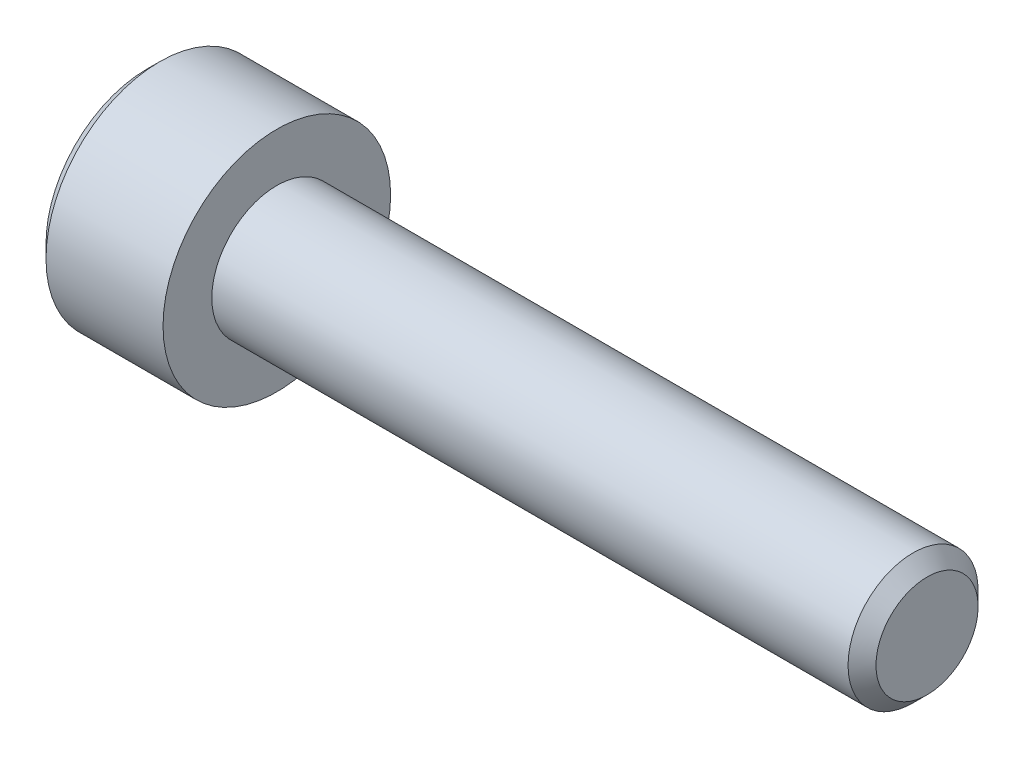
ISO-10303-21;
HEADER;
FILE_DESCRIPTION(('STEP AP214'),'2;1');
FILE_NAME('part.step','',(''),(''),'','','');
FILE_SCHEMA(('AUTOMOTIVE_DESIGN { 1 0 10303 214 1 1 1 1 }'));
ENDSEC;
DATA;
#1=APPLICATION_CONTEXT('core data for automotive mechanical design processes');
#2=APPLICATION_PROTOCOL_DEFINITION('international standard','automotive_design',2000,#1);
#3=PRODUCT_CONTEXT('',#1,'mechanical');
#4=PRODUCT('Part','Part','',(#3));
#5=PRODUCT_RELATED_PRODUCT_CATEGORY('part','',(#4));
#6=PRODUCT_DEFINITION_FORMATION('','',#4);
#7=PRODUCT_DEFINITION_CONTEXT('part definition',#1,'design');
#8=PRODUCT_DEFINITION('design','',#6,#7);
#9=PRODUCT_DEFINITION_SHAPE('','',#8);
#10=(LENGTH_UNIT() NAMED_UNIT(*) SI_UNIT(.MILLI.,.METRE.));
#11=(NAMED_UNIT(*) PLANE_ANGLE_UNIT() SI_UNIT($,.RADIAN.));
#12=(NAMED_UNIT(*) SI_UNIT($,.STERADIAN.) SOLID_ANGLE_UNIT());
#13=UNCERTAINTY_MEASURE_WITH_UNIT(LENGTH_MEASURE(1.E-05),#10,'distance_accuracy_value','');
#14=(GEOMETRIC_REPRESENTATION_CONTEXT(3) GLOBAL_UNCERTAINTY_ASSIGNED_CONTEXT((#13)) GLOBAL_UNIT_ASSIGNED_CONTEXT((#10,
#11,#12)) REPRESENTATION_CONTEXT('',''));
#15=CARTESIAN_POINT('',(0.,0.,0.));
#16=DIRECTION('',(0.,0.,1.));
#17=DIRECTION('',(1.,0.,0.));
#18=AXIS2_PLACEMENT_3D('',#15,#16,#17);
#19=CARTESIAN_POINT('',(-2.,0.,0.));
#20=DIRECTION('',(1.,0.,0.));
#21=DIRECTION('',(0.,0.,-1.));
#22=AXIS2_PLACEMENT_3D('',#19,#20,#21);
#23=PLANE('',#22);
#24=DIRECTION('',(0.,1.,0.));
#25=VECTOR('',#24,1.);
#26=CARTESIAN_POINT('',(-2.,0.866025403784439,1.5));
#27=LINE('',#26,#25);
#28=CARTESIAN_POINT('',(-2.,0.86602540378444,1.5));
#29=VERTEX_POINT('',#28);
#30=CARTESIAN_POINT('',(-1.99999999999056,0.,1.49999999998226));
#31=VERTEX_POINT('',#30);
#32=EDGE_CURVE('E92',#29,#31,#27,.F.);
#33=ORIENTED_EDGE('',*,*,#32,.F.);
#34=DIRECTION('',(0.,0.5,-0.866025403784439));
#35=VECTOR('',#34,1.);
#36=CARTESIAN_POINT('',(-2.,1.73205080756888,0.));
#37=LINE('',#36,#35);
#38=CARTESIAN_POINT('',(-1.99999999999056,1.2990381056613,0.749999999991132));
#39=VERTEX_POINT('',#38);
#40=EDGE_CURVE('E88',#39,#29,#37,.F.);
#41=ORIENTED_EDGE('',*,*,#40,.F.);
#42=CARTESIAN_POINT('',(-1.99999999998113,0.,0.));
#43=DIRECTION('',(-1.,0.,0.));
#44=DIRECTION('',(0.,0.,1.));
#45=AXIS2_PLACEMENT_3D('',#42,#43,#44);
#46=CIRCLE('',#45,1.49999999996453);
#47=EDGE_CURVE('E20',#39,#31,#46,.F.);
#48=ORIENTED_EDGE('',*,*,#47,.T.);
#49=EDGE_LOOP('',(#33,#41,#48));
#50=FACE_BOUND('',#49,.T.);
#51=ADVANCED_FACE('F17',(#50),#23,.F.);
#52=CARTESIAN_POINT('',(-2.,0.,0.));
#53=DIRECTION('',(1.,0.,0.));
#54=DIRECTION('',(0.,0.,-1.));
#55=AXIS2_PLACEMENT_3D('',#52,#53,#54);
#56=PLANE('',#55);
#57=CARTESIAN_POINT('',(-1.99999999998113,0.,0.));
#58=DIRECTION('',(-1.,0.,0.));
#59=DIRECTION('',(0.,0.,1.));
#60=AXIS2_PLACEMENT_3D('',#57,#58,#59);
#61=CIRCLE('',#60,1.49999999996453);
#62=CARTESIAN_POINT('',(-1.99999999999056,1.2990381056613,-0.749999999991131));
#63=VERTEX_POINT('',#62);
#64=EDGE_CURVE('E104',#63,#39,#61,.F.);
#65=ORIENTED_EDGE('',*,*,#64,.T.);
#66=DIRECTION('',(0.,0.5,-0.866025403784439));
#67=VECTOR('',#66,1.);
#68=CARTESIAN_POINT('',(-2.,1.73205080756888,0.));
#69=LINE('',#68,#67);
#70=CARTESIAN_POINT('',(-2.,1.73205080756888,0.));
#71=VERTEX_POINT('',#70);
#72=EDGE_CURVE('E98',#71,#39,#69,.F.);
#73=ORIENTED_EDGE('',*,*,#72,.F.);
#74=DIRECTION('',(0.,-0.5,-0.866025403784439));
#75=VECTOR('',#74,1.);
#76=CARTESIAN_POINT('',(-2.,0.866025403784439,-1.5));
#77=LINE('',#76,#75);
#78=EDGE_CURVE('E114',#63,#71,#77,.F.);
#79=ORIENTED_EDGE('',*,*,#78,.F.);
#80=EDGE_LOOP('',(#65,#73,#79));
#81=FACE_BOUND('',#80,.T.);
#82=ADVANCED_FACE('F111',(#81),#56,.F.);
#83=CARTESIAN_POINT('',(-2.,1.73205080756888,0.));
#84=DIRECTION('',(0.,-0.866025403784439,-0.5));
#85=DIRECTION('',(0.,0.5,-0.866025403784439));
#86=AXIS2_PLACEMENT_3D('',#83,#84,#85);
#87=PLANE('',#86);
#88=ORIENTED_EDGE('',*,*,#40,.T.);
#89=DIRECTION('',(-1.,0.,0.));
#90=VECTOR('',#89,1.);
#91=CARTESIAN_POINT('',(-2.,0.866025403784439,1.5));
#92=LINE('',#91,#90);
#93=CARTESIAN_POINT('',(-4.,0.86602540378444,1.5));
#94=VERTEX_POINT('',#93);
#95=EDGE_CURVE('E132',#94,#29,#92,.F.);
#96=ORIENTED_EDGE('',*,*,#95,.F.);
#97=DIRECTION('',(0.,0.5,-0.866025403784439));
#98=VECTOR('',#97,1.);
#99=CARTESIAN_POINT('',(-4.,1.73205080756888,0.));
#100=LINE('',#99,#98);
#101=CARTESIAN_POINT('',(-4.,1.73205080756888,0.));
#102=VERTEX_POINT('',#101);
#103=EDGE_CURVE('E122',#94,#102,#100,.T.);
#104=ORIENTED_EDGE('',*,*,#103,.T.);
#105=DIRECTION('',(1.,0.,0.));
#106=VECTOR('',#105,1.);
#107=CARTESIAN_POINT('',(-2.,1.73205080756888,0.));
#108=LINE('',#107,#106);
#109=EDGE_CURVE('E121',#71,#102,#108,.F.);
#110=ORIENTED_EDGE('',*,*,#109,.F.);
#111=ORIENTED_EDGE('',*,*,#72,.T.);
#112=EDGE_LOOP('',(#88,#96,#104,#110,#111));
#113=FACE_BOUND('',#112,.T.);
#114=ADVANCED_FACE('F118',(#113),#87,.T.);
#115=CARTESIAN_POINT('',(-2.,0.866025403784439,1.5));
#116=DIRECTION('',(0.,0.,-1.));
#117=DIRECTION('',(-1.,0.,0.));
#118=AXIS2_PLACEMENT_3D('',#115,#116,#117);
#119=PLANE('',#118);
#120=DIRECTION('',(0.,1.,0.));
#121=VECTOR('',#120,1.);
#122=CARTESIAN_POINT('',(-2.,0.,1.5));
#123=LINE('',#122,#121);
#124=CARTESIAN_POINT('',(-2.,-0.866025403784439,1.5));
#125=VERTEX_POINT('',#124);
#126=EDGE_CURVE('E108',#31,#125,#123,.F.);
#127=ORIENTED_EDGE('',*,*,#126,.T.);
#128=DIRECTION('',(1.,0.,0.));
#129=VECTOR('',#128,1.);
#130=CARTESIAN_POINT('',(-2.,-0.866025403784439,1.5));
#131=LINE('',#130,#129);
#132=CARTESIAN_POINT('',(-4.,-0.866025403784439,1.5));
#133=VERTEX_POINT('',#132);
#134=EDGE_CURVE('E177',#133,#125,#131,.T.);
#135=ORIENTED_EDGE('',*,*,#134,.F.);
#136=DIRECTION('',(0.,1.,0.));
#137=VECTOR('',#136,1.);
#138=CARTESIAN_POINT('',(-4.,0.866025403784439,1.5));
#139=LINE('',#138,#137);
#140=EDGE_CURVE('E97',#133,#94,#139,.T.);
#141=ORIENTED_EDGE('',*,*,#140,.T.);
#142=ORIENTED_EDGE('',*,*,#95,.T.);
#143=ORIENTED_EDGE('',*,*,#32,.T.);
#144=EDGE_LOOP('',(#127,#135,#141,#142,#143));
#145=FACE_BOUND('',#144,.T.);
#146=ADVANCED_FACE('F264',(#145),#119,.T.);
#147=CARTESIAN_POINT('',(-2.,0.,0.));
#148=DIRECTION('',(1.,0.,0.));
#149=DIRECTION('',(0.,0.,-1.));
#150=AXIS2_PLACEMENT_3D('',#147,#148,#149);
#151=PLANE('',#150);
#152=DIRECTION('',(0.,0.5,0.866025403784439));
#153=VECTOR('',#152,1.);
#154=CARTESIAN_POINT('',(-2.,-0.866025403784439,1.5));
#155=LINE('',#154,#153);
#156=CARTESIAN_POINT('',(-1.99999999999056,-1.2990381056613,0.749999999991131));
#157=VERTEX_POINT('',#156);
#158=EDGE_CURVE('E168',#125,#157,#155,.F.);
#159=ORIENTED_EDGE('',*,*,#158,.F.);
#160=ORIENTED_EDGE('',*,*,#126,.F.);
#161=CARTESIAN_POINT('',(-1.99999999998113,0.,0.));
#162=DIRECTION('',(-1.,0.,0.));
#163=DIRECTION('',(0.,0.,1.));
#164=AXIS2_PLACEMENT_3D('',#161,#162,#163);
#165=CIRCLE('',#164,1.49999999996453);
#166=EDGE_CURVE('E107',#31,#157,#165,.F.);
#167=ORIENTED_EDGE('',*,*,#166,.T.);
#168=EDGE_LOOP('',(#159,#160,#167));
#169=FACE_BOUND('',#168,.T.);
#170=ADVANCED_FACE('F167',(#169),#151,.F.);
#171=CARTESIAN_POINT('',(-1.99999999998113,0.,0.));
#172=DIRECTION('',(-1.,0.,0.));
#173=DIRECTION('',(0.,0.,1.));
#174=AXIS2_PLACEMENT_3D('',#171,#172,#173);
#175=CONICAL_SURFACE('',#174,1.49999999996453,1.30899693899977);
#176=CARTESIAN_POINT('',(-1.59807621136565,0.,5.6843418860808E-11));
#177=VERTEX_POINT('',#176);
#178=VERTEX_LOOP('',#177);
#179=FACE_BOUND('',#178,.T.);
#180=CARTESIAN_POINT('',(-1.99999999998113,0.,0.));
#181=DIRECTION('',(-1.,0.,0.));
#182=DIRECTION('',(0.,0.,1.));
#183=AXIS2_PLACEMENT_3D('',#180,#181,#182);
#184=CIRCLE('',#183,1.49999999996453);
#185=CARTESIAN_POINT('',(-1.99999999999056,0.,-1.49999999998226));
#186=VERTEX_POINT('',#185);
#187=EDGE_CURVE('E116',#63,#186,#184,.T.);
#188=ORIENTED_EDGE('',*,*,#187,.T.);
#189=CARTESIAN_POINT('',(-1.99999999998113,0.,0.));
#190=DIRECTION('',(-1.,0.,0.));
#191=DIRECTION('',(0.,0.,1.));
#192=AXIS2_PLACEMENT_3D('',#189,#190,#191);
#193=CIRCLE('',#192,1.49999999996453);
#194=CARTESIAN_POINT('',(-1.99999999999056,-1.2990381056613,-0.749999999991133));
#195=VERTEX_POINT('',#194);
#196=EDGE_CURVE('E159',#186,#195,#193,.T.);
#197=ORIENTED_EDGE('',*,*,#196,.T.);
#198=CARTESIAN_POINT('',(-1.99999999998113,0.,0.));
#199=DIRECTION('',(-1.,0.,0.));
#200=DIRECTION('',(0.,0.,1.));
#201=AXIS2_PLACEMENT_3D('',#198,#199,#200);
#202=CIRCLE('',#201,1.49999999996453);
#203=EDGE_CURVE('E161',#195,#157,#202,.T.);
#204=ORIENTED_EDGE('',*,*,#203,.T.);
#205=ORIENTED_EDGE('',*,*,#166,.F.);
#206=ORIENTED_EDGE('',*,*,#47,.F.);
#207=ORIENTED_EDGE('',*,*,#64,.F.);
#208=EDGE_LOOP('',(#188,#197,#204,#205,#206,#207));
#209=FACE_BOUND('',#208,.T.);
#210=ADVANCED_FACE('F103',(#179,#209),#175,.F.);
#211=CARTESIAN_POINT('',(-2.,0.,0.));
#212=DIRECTION('',(1.,0.,0.));
#213=DIRECTION('',(0.,0.,-1.));
#214=AXIS2_PLACEMENT_3D('',#211,#212,#213);
#215=PLANE('',#214);
#216=DIRECTION('',(0.,-0.5,-0.866025403784439));
#217=VECTOR('',#216,1.);
#218=CARTESIAN_POINT('',(-2.,0.866025403784439,-1.5));
#219=LINE('',#218,#217);
#220=CARTESIAN_POINT('',(-2.,0.866025403784438,-1.5));
#221=VERTEX_POINT('',#220);
#222=EDGE_CURVE('E145',#221,#63,#219,.F.);
#223=ORIENTED_EDGE('',*,*,#222,.F.);
#224=DIRECTION('',(0.,1.,0.));
#225=VECTOR('',#224,1.);
#226=CARTESIAN_POINT('',(-2.,-0.866025403784439,-1.5));
#227=LINE('',#226,#225);
#228=EDGE_CURVE('E208',#186,#221,#227,.T.);
#229=ORIENTED_EDGE('',*,*,#228,.F.);
#230=ORIENTED_EDGE('',*,*,#187,.F.);
#231=EDGE_LOOP('',(#223,#229,#230));
#232=FACE_BOUND('',#231,.T.);
#233=ADVANCED_FACE('F239',(#232),#215,.F.);
#234=CARTESIAN_POINT('',(-2.,0.866025403784439,-1.5));
#235=DIRECTION('',(0.,-0.866025403784439,0.5));
#236=DIRECTION('',(0.,-0.5,-0.866025403784439));
#237=AXIS2_PLACEMENT_3D('',#234,#235,#236);
#238=PLANE('',#237);
#239=ORIENTED_EDGE('',*,*,#78,.T.);
#240=ORIENTED_EDGE('',*,*,#109,.T.);
#241=DIRECTION('',(0.,-0.5,-0.866025403784439));
#242=VECTOR('',#241,1.);
#243=CARTESIAN_POINT('',(-4.,0.866025403784439,-1.5));
#244=LINE('',#243,#242);
#245=CARTESIAN_POINT('',(-4.,0.866025403784438,-1.5));
#246=VERTEX_POINT('',#245);
#247=EDGE_CURVE('E142',#102,#246,#244,.T.);
#248=ORIENTED_EDGE('',*,*,#247,.T.);
#249=DIRECTION('',(1.,0.,0.));
#250=VECTOR('',#249,1.);
#251=CARTESIAN_POINT('',(-2.,0.866025403784438,-1.5));
#252=LINE('',#251,#250);
#253=EDGE_CURVE('E196',#221,#246,#252,.F.);
#254=ORIENTED_EDGE('',*,*,#253,.F.);
#255=ORIENTED_EDGE('',*,*,#222,.T.);
#256=EDGE_LOOP('',(#239,#240,#248,#254,#255));
#257=FACE_BOUND('',#256,.T.);
#258=ADVANCED_FACE('F235',(#257),#238,.T.);
#259=CARTESIAN_POINT('',(-2.,-0.866025403784439,1.5));
#260=DIRECTION('',(0.,0.866025403784439,-0.5));
#261=DIRECTION('',(0.,0.5,0.866025403784439));
#262=AXIS2_PLACEMENT_3D('',#259,#260,#261);
#263=PLANE('',#262);
#264=DIRECTION('',(0.,-0.500000000000001,-0.866025403784438));
#265=VECTOR('',#264,1.);
#266=CARTESIAN_POINT('',(-2.,-1.29903810567666,0.75));
#267=LINE('',#266,#265);
#268=CARTESIAN_POINT('',(-2.,-1.73205080756888,0.));
#269=VERTEX_POINT('',#268);
#270=EDGE_CURVE('E163',#157,#269,#267,.T.);
#271=ORIENTED_EDGE('',*,*,#270,.T.);
#272=DIRECTION('',(1.,0.,0.));
#273=VECTOR('',#272,1.);
#274=CARTESIAN_POINT('',(-2.,-1.73205080756888,0.));
#275=LINE('',#274,#273);
#276=CARTESIAN_POINT('',(-4.,-1.73205080756888,0.));
#277=VERTEX_POINT('',#276);
#278=EDGE_CURVE('E194',#277,#269,#275,.T.);
#279=ORIENTED_EDGE('',*,*,#278,.F.);
#280=DIRECTION('',(0.,0.5,0.866025403784439));
#281=VECTOR('',#280,1.);
#282=CARTESIAN_POINT('',(-4.,-0.866025403784439,1.5));
#283=LINE('',#282,#281);
#284=EDGE_CURVE('E199',#277,#133,#283,.T.);
#285=ORIENTED_EDGE('',*,*,#284,.T.);
#286=ORIENTED_EDGE('',*,*,#134,.T.);
#287=ORIENTED_EDGE('',*,*,#158,.T.);
#288=EDGE_LOOP('',(#271,#279,#285,#286,#287));
#289=FACE_BOUND('',#288,.T.);
#290=ADVANCED_FACE('F171',(#289),#263,.T.);
#291=CARTESIAN_POINT('',(-2.,0.,0.));
#292=DIRECTION('',(1.,0.,0.));
#293=DIRECTION('',(0.,0.,-1.));
#294=AXIS2_PLACEMENT_3D('',#291,#292,#293);
#295=PLANE('',#294);
#296=DIRECTION('',(0.,-0.5,0.866025403784439));
#297=VECTOR('',#296,1.);
#298=CARTESIAN_POINT('',(-2.,-1.73205080756888,0.));
#299=LINE('',#298,#297);
#300=EDGE_CURVE('E185',#269,#195,#299,.F.);
#301=ORIENTED_EDGE('',*,*,#300,.F.);
#302=ORIENTED_EDGE('',*,*,#270,.F.);
#303=ORIENTED_EDGE('',*,*,#203,.F.);
#304=EDGE_LOOP('',(#301,#302,#303));
#305=FACE_BOUND('',#304,.T.);
#306=ADVANCED_FACE('F183',(#305),#295,.F.);
#307=CARTESIAN_POINT('',(-2.,0.,0.));
#308=DIRECTION('',(1.,0.,0.));
#309=DIRECTION('',(0.,0.,-1.));
#310=AXIS2_PLACEMENT_3D('',#307,#308,#309);
#311=PLANE('',#310);
#312=DIRECTION('',(0.,1.,0.));
#313=VECTOR('',#312,1.);
#314=CARTESIAN_POINT('',(-2.,-0.866025403784439,-1.5));
#315=LINE('',#314,#313);
#316=CARTESIAN_POINT('',(-2.,-0.866025403784441,-1.5));
#317=VERTEX_POINT('',#316);
#318=EDGE_CURVE('E211',#317,#186,#315,.T.);
#319=ORIENTED_EDGE('',*,*,#318,.F.);
#320=DIRECTION('',(0.,-0.5,0.866025403784439));
#321=VECTOR('',#320,1.);
#322=CARTESIAN_POINT('',(-2.,-1.73205080756888,0.));
#323=LINE('',#322,#321);
#324=EDGE_CURVE('E244',#195,#317,#323,.F.);
#325=ORIENTED_EDGE('',*,*,#324,.F.);
#326=ORIENTED_EDGE('',*,*,#196,.F.);
#327=EDGE_LOOP('',(#319,#325,#326));
#328=FACE_BOUND('',#327,.T.);
#329=ADVANCED_FACE('F242',(#328),#311,.F.);
#330=CARTESIAN_POINT('',(-2.,-0.866025403784439,-1.5));
#331=DIRECTION('',(0.,0.,1.));
#332=DIRECTION('',(1.,0.,0.));
#333=AXIS2_PLACEMENT_3D('',#330,#331,#332);
#334=PLANE('',#333);
#335=ORIENTED_EDGE('',*,*,#228,.T.);
#336=ORIENTED_EDGE('',*,*,#253,.T.);
#337=DIRECTION('',(0.,1.,0.));
#338=VECTOR('',#337,1.);
#339=CARTESIAN_POINT('',(-4.,-0.866025403784439,-1.5));
#340=LINE('',#339,#338);
#341=CARTESIAN_POINT('',(-4.,-0.86602540378444,-1.5));
#342=VERTEX_POINT('',#341);
#343=EDGE_CURVE('E35',#246,#342,#340,.F.);
#344=ORIENTED_EDGE('',*,*,#343,.T.);
#345=DIRECTION('',(1.,0.,0.));
#346=VECTOR('',#345,1.);
#347=CARTESIAN_POINT('',(-2.,-0.866025403784441,-1.5));
#348=LINE('',#347,#346);
#349=EDGE_CURVE('E205',#317,#342,#348,.F.);
#350=ORIENTED_EDGE('',*,*,#349,.F.);
#351=ORIENTED_EDGE('',*,*,#318,.T.);
#352=EDGE_LOOP('',(#335,#336,#344,#350,#351));
#353=FACE_BOUND('',#352,.T.);
#354=ADVANCED_FACE('F258',(#353),#334,.T.);
#355=CARTESIAN_POINT('',(-2.,-1.73205080756888,0.));
#356=DIRECTION('',(0.,0.866025403784439,0.5));
#357=DIRECTION('',(0.,-0.5,0.866025403784439));
#358=AXIS2_PLACEMENT_3D('',#355,#356,#357);
#359=PLANE('',#358);
#360=ORIENTED_EDGE('',*,*,#324,.T.);
#361=ORIENTED_EDGE('',*,*,#349,.T.);
#362=DIRECTION('',(0.,-0.500000000000001,0.866025403784438));
#363=VECTOR('',#362,1.);
#364=CARTESIAN_POINT('',(-4.,-0.866025403784439,-1.5));
#365=LINE('',#364,#363);
#366=EDGE_CURVE('E158',#342,#277,#365,.T.);
#367=ORIENTED_EDGE('',*,*,#366,.T.);
#368=ORIENTED_EDGE('',*,*,#278,.T.);
#369=ORIENTED_EDGE('',*,*,#300,.T.);
#370=EDGE_LOOP('',(#360,#361,#367,#368,#369));
#371=FACE_BOUND('',#370,.T.);
#372=ADVANCED_FACE('F247',(#371),#359,.T.);
#373=CARTESIAN_POINT('',(-4.,0.,0.));
#374=DIRECTION('',(1.,0.,0.));
#375=DIRECTION('',(0.,0.,-1.));
#376=AXIS2_PLACEMENT_3D('',#373,#374,#375);
#377=PLANE('',#376);
#378=ORIENTED_EDGE('',*,*,#343,.F.);
#379=ORIENTED_EDGE('',*,*,#247,.F.);
#380=ORIENTED_EDGE('',*,*,#103,.F.);
#381=ORIENTED_EDGE('',*,*,#140,.F.);
#382=ORIENTED_EDGE('',*,*,#284,.F.);
#383=ORIENTED_EDGE('',*,*,#366,.F.);
#384=EDGE_LOOP('',(#378,#379,#380,#381,#382,#383));
#385=FACE_BOUND('',#384,.T.);
#386=CARTESIAN_POINT('',(-4.0000000000191,0.,0.));
#387=DIRECTION('',(1.,0.,0.));
#388=DIRECTION('',(0.,1.,0.));
#389=AXIS2_PLACEMENT_3D('',#386,#387,#388);
#390=CIRCLE('',#389,3.0999999999608);
#391=CARTESIAN_POINT('',(-4.0000000000191,3.0999999999608,0.));
#392=VERTEX_POINT('',#391);
#393=EDGE_CURVE('E155',#392,#392,#390,.T.);
#394=ORIENTED_EDGE('',*,*,#393,.F.);
#395=EDGE_LOOP('',(#394));
#396=FACE_BOUND('',#395,.T.);
#397=ADVANCED_FACE('F261',(#385,#396),#377,.F.);
#398=CARTESIAN_POINT('',(-3.60000000006266,0.,0.));
#399=DIRECTION('',(1.,0.,0.));
#400=DIRECTION('',(0.,1.,0.));
#401=AXIS2_PLACEMENT_3D('',#398,#399,#400);
#402=CONICAL_SURFACE('',#401,3.49999999997408,0.785398163468503);
#403=ORIENTED_EDGE('',*,*,#393,.T.);
#404=EDGE_LOOP('',(#403));
#405=FACE_BOUND('',#404,.T.);
#406=CARTESIAN_POINT('',(-3.6,0.,0.));
#407=DIRECTION('',(-1.,0.,0.));
#408=DIRECTION('',(0.,0.,1.));
#409=AXIS2_PLACEMENT_3D('',#406,#407,#408);
#410=CIRCLE('',#409,3.5);
#411=CARTESIAN_POINT('',(-3.6,0.,3.5));
#412=VERTEX_POINT('',#411);
#413=EDGE_CURVE('E154',#412,#412,#410,.F.);
#414=ORIENTED_EDGE('',*,*,#413,.F.);
#415=EDGE_LOOP('',(#414));
#416=FACE_BOUND('',#415,.T.);
#417=ADVANCED_FACE('F297',(#405,#416),#402,.T.);
#418=CARTESIAN_POINT('',(20.,1.5705,0.));
#419=DIRECTION('',(-1.,0.,0.));
#420=DIRECTION('',(0.,0.,1.));
#421=AXIS2_PLACEMENT_3D('',#418,#419,#420);
#422=PLANE('',#421);
#423=CARTESIAN_POINT('',(19.999999999925,0.,0.));
#424=DIRECTION('',(-1.,0.,0.));
#425=DIRECTION('',(0.,0.,1.));
#426=AXIS2_PLACEMENT_3D('',#423,#424,#425);
#427=CIRCLE('',#426,1.57050000001391);
#428=CARTESIAN_POINT('',(19.999999999925,0.,1.57050000001391));
#429=VERTEX_POINT('',#428);
#430=EDGE_CURVE('E151',#429,#429,#427,.T.);
#431=ORIENTED_EDGE('',*,*,#430,.F.);
#432=EDGE_LOOP('',(#431));
#433=FACE_BOUND('',#432,.T.);
#434=ADVANCED_FACE('F293',(#433),#422,.F.);
#435=CARTESIAN_POINT('',(20.,0.,0.));
#436=DIRECTION('',(-1.,0.,0.));
#437=DIRECTION('',(0.,0.,1.));
#438=AXIS2_PLACEMENT_3D('',#435,#436,#437);
#439=CYLINDRICAL_SURFACE('',#438,3.5);
#440=ORIENTED_EDGE('',*,*,#413,.T.);
#441=EDGE_LOOP('',(#440));
#442=FACE_BOUND('',#441,.T.);
#443=CARTESIAN_POINT('',(0.,0.,0.));
#444=DIRECTION('',(-1.,0.,0.));
#445=DIRECTION('',(0.,0.,1.));
#446=AXIS2_PLACEMENT_3D('',#443,#444,#445);
#447=CIRCLE('',#446,3.5);
#448=CARTESIAN_POINT('',(0.,0.,3.5));
#449=VERTEX_POINT('',#448);
#450=EDGE_CURVE('E148',#449,#449,#447,.T.);
#451=ORIENTED_EDGE('',*,*,#450,.T.);
#452=EDGE_LOOP('',(#451));
#453=FACE_BOUND('',#452,.T.);
#454=ADVANCED_FACE('F289',(#442,#453),#439,.T.);
#455=CARTESIAN_POINT('',(19.5704999999862,0.,0.));
#456=DIRECTION('',(-1.,0.,0.));
#457=DIRECTION('',(0.,0.,1.));
#458=AXIS2_PLACEMENT_3D('',#455,#456,#457);
#459=CONICAL_SURFACE('',#458,1.99999999995271,0.785398163397448);
#460=CARTESIAN_POINT('',(19.5705,0.,0.));
#461=DIRECTION('',(-1.,0.,0.));
#462=DIRECTION('',(0.,0.,1.));
#463=AXIS2_PLACEMENT_3D('',#460,#461,#462);
#464=CIRCLE('',#463,2.);
#465=CARTESIAN_POINT('',(19.5705,0.,2.));
#466=VERTEX_POINT('',#465);
#467=EDGE_CURVE('E26',#466,#466,#464,.T.);
#468=ORIENTED_EDGE('',*,*,#467,.F.);
#469=EDGE_LOOP('',(#468));
#470=FACE_BOUND('',#469,.T.);
#471=ORIENTED_EDGE('',*,*,#430,.T.);
#472=EDGE_LOOP('',(#471));
#473=FACE_BOUND('',#472,.T.);
#474=ADVANCED_FACE('F282',(#470,#473),#459,.T.);
#475=CARTESIAN_POINT('',(0.,3.5,0.));
#476=DIRECTION('',(-1.,0.,0.));
#477=DIRECTION('',(0.,0.,1.));
#478=AXIS2_PLACEMENT_3D('',#475,#476,#477);
#479=PLANE('',#478);
#480=ORIENTED_EDGE('',*,*,#450,.F.);
#481=EDGE_LOOP('',(#480));
#482=FACE_BOUND('',#481,.T.);
#483=CARTESIAN_POINT('',(0.,0.,0.));
#484=DIRECTION('',(-1.,0.,0.));
#485=DIRECTION('',(0.,0.,1.));
#486=AXIS2_PLACEMENT_3D('',#483,#484,#485);
#487=CIRCLE('',#486,2.);
#488=CARTESIAN_POINT('',(0.,0.,2.));
#489=VERTEX_POINT('',#488);
#490=EDGE_CURVE('E11',#489,#489,#487,.F.);
#491=ORIENTED_EDGE('',*,*,#490,.F.);
#492=EDGE_LOOP('',(#491));
#493=FACE_BOUND('',#492,.T.);
#494=ADVANCED_FACE('F276',(#482,#493),#479,.F.);
#495=CARTESIAN_POINT('',(20.,0.,0.));
#496=DIRECTION('',(-1.,0.,0.));
#497=DIRECTION('',(0.,0.,1.));
#498=AXIS2_PLACEMENT_3D('',#495,#496,#497);
#499=CYLINDRICAL_SURFACE('',#498,2.);
#500=ORIENTED_EDGE('',*,*,#490,.T.);
#501=EDGE_LOOP('',(#500));
#502=FACE_BOUND('',#501,.T.);
#503=ORIENTED_EDGE('',*,*,#467,.T.);
#504=EDGE_LOOP('',(#503));
#505=FACE_BOUND('',#504,.T.);
#506=ADVANCED_FACE('F274',(#502,#505),#499,.T.);
#507=CLOSED_SHELL('',(#51,#82,#114,#146,#170,#210,#233,#258,#290,#306,#329,#354,#372,#397,#417,
#434,#454,#474,#494,#506));
#508=MANIFOLD_SOLID_BREP('B1',#507);
#509=ADVANCED_BREP_SHAPE_REPRESENTATION('',(#18,#508),#14);
#510=SHAPE_DEFINITION_REPRESENTATION(#9,#509);
ENDSEC;
END-ISO-10303-21;
